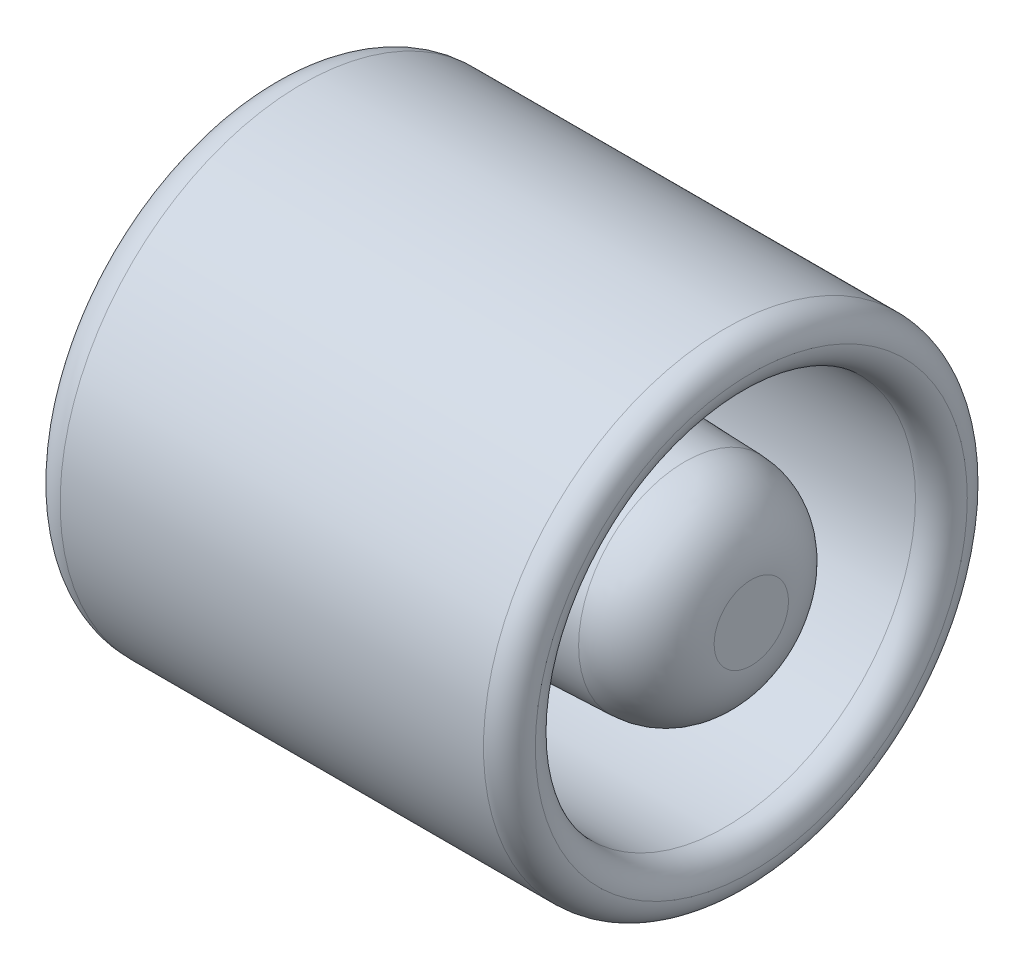
ISO-10303-21;
HEADER;
FILE_DESCRIPTION(('STEP AP214'),'2;1');
FILE_NAME('part.step','',(''),(''),'','','');
FILE_SCHEMA(('AUTOMOTIVE_DESIGN { 1 0 10303 214 1 1 1 1 }'));
ENDSEC;
DATA;
#1=APPLICATION_CONTEXT('core data for automotive mechanical design processes');
#2=APPLICATION_PROTOCOL_DEFINITION('international standard','automotive_design',2000,#1);
#3=PRODUCT_CONTEXT('',#1,'mechanical');
#4=PRODUCT('Part','Part','',(#3));
#5=PRODUCT_RELATED_PRODUCT_CATEGORY('part','',(#4));
#6=PRODUCT_DEFINITION_FORMATION('','',#4);
#7=PRODUCT_DEFINITION_CONTEXT('part definition',#1,'design');
#8=PRODUCT_DEFINITION('design','',#6,#7);
#9=PRODUCT_DEFINITION_SHAPE('','',#8);
#10=(LENGTH_UNIT() NAMED_UNIT(*) SI_UNIT(.MILLI.,.METRE.));
#11=(NAMED_UNIT(*) PLANE_ANGLE_UNIT() SI_UNIT($,.RADIAN.));
#12=(NAMED_UNIT(*) SI_UNIT($,.STERADIAN.) SOLID_ANGLE_UNIT());
#13=UNCERTAINTY_MEASURE_WITH_UNIT(LENGTH_MEASURE(1.E-05),#10,'distance_accuracy_value','');
#14=(GEOMETRIC_REPRESENTATION_CONTEXT(3) GLOBAL_UNCERTAINTY_ASSIGNED_CONTEXT((#13)) GLOBAL_UNIT_ASSIGNED_CONTEXT((#10,
#11,#12)) REPRESENTATION_CONTEXT('',''));
#15=CARTESIAN_POINT('',(0.,0.,0.));
#16=DIRECTION('',(0.,0.,1.));
#17=DIRECTION('',(1.,0.,0.));
#18=AXIS2_PLACEMENT_3D('',#15,#16,#17);
#19=CARTESIAN_POINT('',(-5.29557581994012,0.,0.));
#20=DIRECTION('',(-1.,0.,0.));
#21=DIRECTION('',(0.,0.,1.));
#22=AXIS2_PLACEMENT_3D('',#19,#20,#21);
#23=CYLINDRICAL_SURFACE('',#22,1.2);
#24=CARTESIAN_POINT('',(5.8,0.,0.));
#25=DIRECTION('',(1.,0.,0.));
#26=DIRECTION('',(0.,0.,-1.));
#27=AXIS2_PLACEMENT_3D('',#24,#25,#26);
#28=CIRCLE('',#27,1.2);
#29=CARTESIAN_POINT('',(5.8,0.,-1.2));
#30=VERTEX_POINT('',#29);
#31=EDGE_CURVE('E77',#30,#30,#28,.T.);
#32=ORIENTED_EDGE('',*,*,#31,.T.);
#33=EDGE_LOOP('',(#32));
#34=FACE_BOUND('',#33,.T.);
#35=CARTESIAN_POINT('',(0.0999999999999994,0.,0.));
#36=DIRECTION('',(1.,0.,0.));
#37=DIRECTION('',(0.,0.,-1.));
#38=AXIS2_PLACEMENT_3D('',#35,#36,#37);
#39=CIRCLE('',#38,1.2);
#40=CARTESIAN_POINT('',(0.0999999999999994,0.,-1.2));
#41=VERTEX_POINT('',#40);
#42=EDGE_CURVE('E65',#41,#41,#39,.F.);
#43=ORIENTED_EDGE('',*,*,#42,.T.);
#44=EDGE_LOOP('',(#43));
#45=FACE_BOUND('',#44,.T.);
#46=ADVANCED_FACE('F35',(#34,#45),#23,.F.);
#47=CARTESIAN_POINT('',(0.,1.2,0.));
#48=DIRECTION('',(1.,0.,0.));
#49=DIRECTION('',(0.,0.,-1.));
#50=AXIS2_PLACEMENT_3D('',#47,#48,#49);
#51=PLANE('',#50);
#52=CARTESIAN_POINT('',(0.,0.,0.));
#53=DIRECTION('',(1.,0.,0.));
#54=DIRECTION('',(0.,0.,-1.));
#55=AXIS2_PLACEMENT_3D('',#52,#53,#54);
#56=CIRCLE('',#55,3.);
#57=CARTESIAN_POINT('',(0.,0.,-3.));
#58=VERTEX_POINT('',#57);
#59=EDGE_CURVE('E42',#58,#58,#56,.F.);
#60=ORIENTED_EDGE('',*,*,#59,.T.);
#61=EDGE_LOOP('',(#60));
#62=FACE_BOUND('',#61,.T.);
#63=CARTESIAN_POINT('',(0.,0.,0.));
#64=DIRECTION('',(1.,0.,0.));
#65=DIRECTION('',(0.,0.,-1.));
#66=AXIS2_PLACEMENT_3D('',#63,#64,#65);
#67=CIRCLE('',#66,1.3);
#68=CARTESIAN_POINT('',(0.,0.,-1.3));
#69=VERTEX_POINT('',#68);
#70=EDGE_CURVE('E83',#69,#69,#67,.T.);
#71=ORIENTED_EDGE('',*,*,#70,.T.);
#72=EDGE_LOOP('',(#71));
#73=FACE_BOUND('',#72,.T.);
#74=ADVANCED_FACE('F109',(#62,#73),#51,.F.);
#75=CARTESIAN_POINT('',(-5.29557581994012,0.,0.));
#76=DIRECTION('',(-1.,0.,0.));
#77=DIRECTION('',(0.,0.,1.));
#78=AXIS2_PLACEMENT_3D('',#75,#76,#77);
#79=CYLINDRICAL_SURFACE('',#78,3.5);
#80=CARTESIAN_POINT('',(0.5,0.,0.));
#81=DIRECTION('',(1.,0.,0.));
#82=DIRECTION('',(0.,0.,-1.));
#83=AXIS2_PLACEMENT_3D('',#80,#81,#82);
#84=CIRCLE('',#83,3.5);
#85=CARTESIAN_POINT('',(0.5,0.,-3.5));
#86=VERTEX_POINT('',#85);
#87=EDGE_CURVE('E10',#86,#86,#84,.T.);
#88=ORIENTED_EDGE('',*,*,#87,.T.);
#89=EDGE_LOOP('',(#88));
#90=FACE_BOUND('',#89,.T.);
#91=CARTESIAN_POINT('',(6.625,0.,0.));
#92=DIRECTION('',(1.,0.,0.));
#93=DIRECTION('',(0.,0.,-1.));
#94=AXIS2_PLACEMENT_3D('',#91,#92,#93);
#95=CIRCLE('',#94,3.5);
#96=CARTESIAN_POINT('',(6.625,0.,-3.5));
#97=VERTEX_POINT('',#96);
#98=EDGE_CURVE('E68',#97,#97,#95,.F.);
#99=ORIENTED_EDGE('',*,*,#98,.T.);
#100=EDGE_LOOP('',(#99));
#101=FACE_BOUND('',#100,.T.);
#102=ADVANCED_FACE('F114',(#90,#101),#79,.T.);
#103=CARTESIAN_POINT('',(6.,1.2,0.));
#104=DIRECTION('',(1.,0.,0.));
#105=DIRECTION('',(0.,0.,-1.));
#106=AXIS2_PLACEMENT_3D('',#103,#104,#105);
#107=PLANE('',#106);
#108=CARTESIAN_POINT('',(6.,0.,0.));
#109=DIRECTION('',(1.,0.,0.));
#110=DIRECTION('',(0.,0.,-1.));
#111=AXIS2_PLACEMENT_3D('',#108,#109,#110);
#112=CIRCLE('',#111,1.);
#113=CARTESIAN_POINT('',(6.,0.,-1.));
#114=VERTEX_POINT('',#113);
#115=EDGE_CURVE('E80',#114,#114,#112,.F.);
#116=ORIENTED_EDGE('',*,*,#115,.T.);
#117=EDGE_LOOP('',(#116));
#118=FACE_BOUND('',#117,.T.);
#119=ADVANCED_FACE('F118',(#118),#107,.F.);
#120=CARTESIAN_POINT('',(7.,0.,0.));
#121=DIRECTION('',(-1.,0.,0.));
#122=DIRECTION('',(0.,0.,1.));
#123=AXIS2_PLACEMENT_3D('',#120,#121,#122);
#124=CYLINDRICAL_SURFACE('',#123,2.75);
#125=CARTESIAN_POINT('',(2.5,0.,0.));
#126=DIRECTION('',(-1.,0.,0.));
#127=DIRECTION('',(0.,0.,1.));
#128=AXIS2_PLACEMENT_3D('',#125,#126,#127);
#129=CIRCLE('',#128,2.75);
#130=CARTESIAN_POINT('',(2.5,0.,2.75));
#131=VERTEX_POINT('',#130);
#132=EDGE_CURVE('E46',#131,#131,#129,.T.);
#133=ORIENTED_EDGE('',*,*,#132,.T.);
#134=EDGE_LOOP('',(#133));
#135=FACE_BOUND('',#134,.T.);
#136=CARTESIAN_POINT('',(6.625,0.,0.));
#137=DIRECTION('',(1.,0.,0.));
#138=DIRECTION('',(0.,0.,-1.));
#139=AXIS2_PLACEMENT_3D('',#136,#137,#138);
#140=CIRCLE('',#139,2.75);
#141=CARTESIAN_POINT('',(6.625,0.,-2.75));
#142=VERTEX_POINT('',#141);
#143=EDGE_CURVE('E61',#142,#142,#140,.T.);
#144=ORIENTED_EDGE('',*,*,#143,.T.);
#145=EDGE_LOOP('',(#144));
#146=FACE_BOUND('',#145,.T.);
#147=ADVANCED_FACE('F126',(#135,#146),#124,.F.);
#148=CARTESIAN_POINT('',(7.,1.5,0.));
#149=DIRECTION('',(-1.,0.,0.));
#150=DIRECTION('',(0.,0.,1.));
#151=AXIS2_PLACEMENT_3D('',#148,#149,#150);
#152=PLANE('',#151);
#153=CARTESIAN_POINT('',(7.,0.,0.));
#154=DIRECTION('',(-1.,0.,0.));
#155=DIRECTION('',(0.,0.,1.));
#156=AXIS2_PLACEMENT_3D('',#153,#154,#155);
#157=CIRCLE('',#156,0.537678497700469);
#158=CARTESIAN_POINT('',(7.,0.,0.537678497700469));
#159=VERTEX_POINT('',#158);
#160=EDGE_CURVE('E71',#159,#159,#157,.F.);
#161=ORIENTED_EDGE('',*,*,#160,.T.);
#162=EDGE_LOOP('',(#161));
#163=FACE_BOUND('',#162,.T.);
#164=ADVANCED_FACE('F122',(#163),#152,.F.);
#165=CARTESIAN_POINT('',(7.,0.,0.));
#166=DIRECTION('',(-1.,0.,0.));
#167=DIRECTION('',(0.,0.,1.));
#168=AXIS2_PLACEMENT_3D('',#165,#166,#167);
#169=CONICAL_SURFACE('',#168,1.5,0.0383972435438754);
#170=CARTESIAN_POINT('',(2.48080609545624,0.,0.));
#171=DIRECTION('',(-1.,0.,0.));
#172=DIRECTION('',(0.,0.,1.));
#173=AXIS2_PLACEMENT_3D('',#170,#171,#172);
#174=CIRCLE('',#173,1.67360991785852);
#175=CARTESIAN_POINT('',(2.48080609545624,0.,1.67360991785852));
#176=VERTEX_POINT('',#175);
#177=EDGE_CURVE('E50',#176,#176,#174,.F.);
#178=ORIENTED_EDGE('',*,*,#177,.T.);
#179=EDGE_LOOP('',(#178));
#180=FACE_BOUND('',#179,.T.);
#181=CARTESIAN_POINT('',(6.03838780908753,0.,0.));
#182=DIRECTION('',(1.,0.,0.));
#183=DIRECTION('',(0.,0.,-1.));
#184=AXIS2_PLACEMENT_3D('',#181,#182,#183);
#185=CIRCLE('',#184,1.53694141411109);
#186=CARTESIAN_POINT('',(6.03838780908753,0.,-1.53694141411109));
#187=VERTEX_POINT('',#186);
#188=EDGE_CURVE('E74',#187,#187,#185,.F.);
#189=ORIENTED_EDGE('',*,*,#188,.T.);
#190=EDGE_LOOP('',(#189));
#191=FACE_BOUND('',#190,.T.);
#192=ADVANCED_FACE('F103',(#180,#191),#169,.T.);
#193=CARTESIAN_POINT('',(2.,3.5,0.));
#194=DIRECTION('',(-1.,0.,0.));
#195=DIRECTION('',(0.,0.,1.));
#196=AXIS2_PLACEMENT_3D('',#193,#194,#195);
#197=PLANE('',#196);
#198=CARTESIAN_POINT('',(2.,0.,0.));
#199=DIRECTION('',(-1.,0.,0.));
#200=DIRECTION('',(0.,0.,1.));
#201=AXIS2_PLACEMENT_3D('',#198,#199,#200);
#202=CIRCLE('',#201,2.17324137606383);
#203=CARTESIAN_POINT('',(2.,0.,2.17324137606383));
#204=VERTEX_POINT('',#203);
#205=EDGE_CURVE('E55',#204,#204,#202,.T.);
#206=ORIENTED_EDGE('',*,*,#205,.T.);
#207=EDGE_LOOP('',(#206));
#208=FACE_BOUND('',#207,.T.);
#209=CARTESIAN_POINT('',(2.,0.,0.));
#210=DIRECTION('',(-1.,0.,0.));
#211=DIRECTION('',(0.,0.,1.));
#212=AXIS2_PLACEMENT_3D('',#209,#210,#211);
#213=CIRCLE('',#212,2.25);
#214=CARTESIAN_POINT('',(2.,0.,2.25));
#215=VERTEX_POINT('',#214);
#216=EDGE_CURVE('E58',#215,#215,#213,.F.);
#217=ORIENTED_EDGE('',*,*,#216,.T.);
#218=EDGE_LOOP('',(#217));
#219=FACE_BOUND('',#218,.T.);
#220=ADVANCED_FACE('F93',(#208,#219),#197,.F.);
#221=CARTESIAN_POINT('',(0.0999999999999994,0.,0.));
#222=DIRECTION('',(1.,0.,0.));
#223=DIRECTION('',(0.,0.,-1.));
#224=AXIS2_PLACEMENT_3D('',#221,#222,#223);
#225=TOROIDAL_SURFACE('',#224,1.3,0.1);
#226=ORIENTED_EDGE('',*,*,#70,.F.);
#227=EDGE_LOOP('',(#226));
#228=FACE_BOUND('',#227,.T.);
#229=ORIENTED_EDGE('',*,*,#42,.F.);
#230=EDGE_LOOP('',(#229));
#231=FACE_BOUND('',#230,.T.);
#232=ADVANCED_FACE('F90',(#228,#231),#225,.T.);
#233=CARTESIAN_POINT('',(5.8,0.,0.));
#234=DIRECTION('',(1.,0.,0.));
#235=DIRECTION('',(0.,0.,-1.));
#236=AXIS2_PLACEMENT_3D('',#233,#234,#235);
#237=TOROIDAL_SURFACE('',#236,1.,0.2);
#238=ORIENTED_EDGE('',*,*,#31,.F.);
#239=EDGE_LOOP('',(#238));
#240=FACE_BOUND('',#239,.T.);
#241=ORIENTED_EDGE('',*,*,#115,.F.);
#242=EDGE_LOOP('',(#241));
#243=FACE_BOUND('',#242,.T.);
#244=ADVANCED_FACE('F92',(#240,#243),#237,.F.);
#245=CARTESIAN_POINT('',(6.,0.,0.));
#246=DIRECTION('',(-1.,0.,0.));
#247=DIRECTION('',(0.,0.,1.));
#248=AXIS2_PLACEMENT_3D('',#245,#246,#247);
#249=DEGENERATE_TOROIDAL_SURFACE('',#248,0.537678497700469,1.,.T.);
#250=ORIENTED_EDGE('',*,*,#160,.F.);
#251=EDGE_LOOP('',(#250));
#252=FACE_BOUND('',#251,.T.);
#253=ORIENTED_EDGE('',*,*,#188,.F.);
#254=EDGE_LOOP('',(#253));
#255=FACE_BOUND('',#254,.T.);
#256=ADVANCED_FACE('F100',(#252,#255),#249,.T.);
#257=CARTESIAN_POINT('',(6.625,0.,0.));
#258=DIRECTION('',(1.,0.,0.));
#259=DIRECTION('',(0.,0.,-1.));
#260=AXIS2_PLACEMENT_3D('',#257,#258,#259);
#261=TOROIDAL_SURFACE('',#260,3.125,0.375);
#262=ORIENTED_EDGE('',*,*,#143,.F.);
#263=EDGE_LOOP('',(#262));
#264=FACE_BOUND('',#263,.T.);
#265=CARTESIAN_POINT('',(7.,0.,0.));
#266=DIRECTION('',(1.,0.,0.));
#267=DIRECTION('',(0.,0.,-1.));
#268=AXIS2_PLACEMENT_3D('',#265,#266,#267);
#269=CIRCLE('',#268,3.125);
#270=CARTESIAN_POINT('',(7.,0.,-3.125));
#271=VERTEX_POINT('',#270);
#272=EDGE_CURVE('E62',#271,#271,#269,.F.);
#273=ORIENTED_EDGE('',*,*,#272,.F.);
#274=EDGE_LOOP('',(#273));
#275=FACE_BOUND('',#274,.T.);
#276=ADVANCED_FACE('F139',(#264,#275),#261,.T.);
#277=CARTESIAN_POINT('',(6.625,0.,0.));
#278=DIRECTION('',(1.,0.,0.));
#279=DIRECTION('',(0.,0.,-1.));
#280=AXIS2_PLACEMENT_3D('',#277,#278,#279);
#281=TOROIDAL_SURFACE('',#280,3.125,0.375);
#282=ORIENTED_EDGE('',*,*,#98,.F.);
#283=EDGE_LOOP('',(#282));
#284=FACE_BOUND('',#283,.T.);
#285=ORIENTED_EDGE('',*,*,#272,.T.);
#286=EDGE_LOOP('',(#285));
#287=FACE_BOUND('',#286,.T.);
#288=ADVANCED_FACE('F142',(#284,#287),#281,.T.);
#289=CARTESIAN_POINT('',(2.5,0.,0.));
#290=DIRECTION('',(-1.,0.,0.));
#291=DIRECTION('',(0.,0.,1.));
#292=AXIS2_PLACEMENT_3D('',#289,#290,#291);
#293=TOROIDAL_SURFACE('',#292,2.17324137606383,0.5);
#294=ORIENTED_EDGE('',*,*,#177,.F.);
#295=EDGE_LOOP('',(#294));
#296=FACE_BOUND('',#295,.T.);
#297=ORIENTED_EDGE('',*,*,#205,.F.);
#298=EDGE_LOOP('',(#297));
#299=FACE_BOUND('',#298,.T.);
#300=ADVANCED_FACE('F147',(#296,#299),#293,.F.);
#301=CARTESIAN_POINT('',(2.5,0.,0.));
#302=DIRECTION('',(-1.,0.,0.));
#303=DIRECTION('',(0.,0.,1.));
#304=AXIS2_PLACEMENT_3D('',#301,#302,#303);
#305=TOROIDAL_SURFACE('',#304,2.25,0.5);
#306=ORIENTED_EDGE('',*,*,#132,.F.);
#307=EDGE_LOOP('',(#306));
#308=FACE_BOUND('',#307,.T.);
#309=ORIENTED_EDGE('',*,*,#216,.F.);
#310=EDGE_LOOP('',(#309));
#311=FACE_BOUND('',#310,.T.);
#312=ADVANCED_FACE('F153',(#308,#311),#305,.F.);
#313=CARTESIAN_POINT('',(0.5,0.,0.));
#314=DIRECTION('',(1.,0.,0.));
#315=DIRECTION('',(0.,0.,-1.));
#316=AXIS2_PLACEMENT_3D('',#313,#314,#315);
#317=TOROIDAL_SURFACE('',#316,3.,0.5);
#318=ORIENTED_EDGE('',*,*,#87,.F.);
#319=EDGE_LOOP('',(#318));
#320=FACE_BOUND('',#319,.T.);
#321=ORIENTED_EDGE('',*,*,#59,.F.);
#322=EDGE_LOOP('',(#321));
#323=FACE_BOUND('',#322,.T.);
#324=ADVANCED_FACE('F37',(#320,#323),#317,.T.);
#325=CLOSED_SHELL('',(#46,#74,#102,#119,#147,#164,#192,#220,#232,#244,#256,#276,#288,#300,#312,#324));
#326=MANIFOLD_SOLID_BREP('B2',#325);
#327=ADVANCED_BREP_SHAPE_REPRESENTATION('',(#18,#326),#14);
#328=SHAPE_DEFINITION_REPRESENTATION(#9,#327);
ENDSEC;
END-ISO-10303-21;
